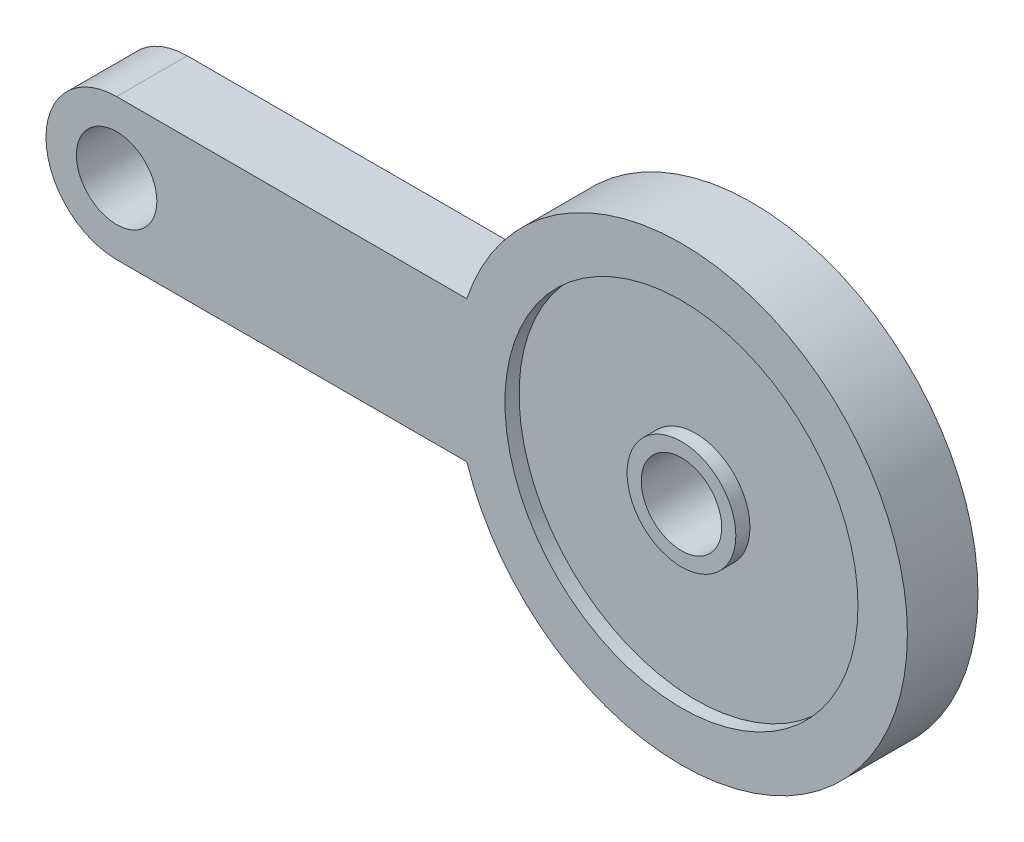
ISO-10303-21;
HEADER;
FILE_DESCRIPTION(('STEP AP214'),'2;1');
FILE_NAME('part.step','',(''),(''),'','','');
FILE_SCHEMA(('AUTOMOTIVE_DESIGN { 1 0 10303 214 1 1 1 1 }'));
ENDSEC;
DATA;
#1=APPLICATION_CONTEXT('core data for automotive mechanical design processes');
#2=APPLICATION_PROTOCOL_DEFINITION('international standard','automotive_design',2000,#1);
#3=PRODUCT_CONTEXT('',#1,'mechanical');
#4=PRODUCT('Part','Part','',(#3));
#5=PRODUCT_RELATED_PRODUCT_CATEGORY('part','',(#4));
#6=PRODUCT_DEFINITION_FORMATION('','',#4);
#7=PRODUCT_DEFINITION_CONTEXT('part definition',#1,'design');
#8=PRODUCT_DEFINITION('design','',#6,#7);
#9=PRODUCT_DEFINITION_SHAPE('','',#8);
#10=(LENGTH_UNIT() NAMED_UNIT(*) SI_UNIT(.MILLI.,.METRE.));
#11=(NAMED_UNIT(*) PLANE_ANGLE_UNIT() SI_UNIT($,.RADIAN.));
#12=(NAMED_UNIT(*) SI_UNIT($,.STERADIAN.) SOLID_ANGLE_UNIT());
#13=UNCERTAINTY_MEASURE_WITH_UNIT(LENGTH_MEASURE(1.E-05),#10,'distance_accuracy_value','');
#14=(GEOMETRIC_REPRESENTATION_CONTEXT(3) GLOBAL_UNCERTAINTY_ASSIGNED_CONTEXT((#13)) GLOBAL_UNIT_ASSIGNED_CONTEXT((#10,
#11,#12)) REPRESENTATION_CONTEXT('',''));
#15=CARTESIAN_POINT('',(0.,0.,0.));
#16=DIRECTION('',(0.,0.,1.));
#17=DIRECTION('',(1.,0.,0.));
#18=AXIS2_PLACEMENT_3D('',#15,#16,#17);
#19=CARTESIAN_POINT('',(20.,0.,1.5));
#20=DIRECTION('',(0.,0.,1.));
#21=DIRECTION('',(1.,0.,0.));
#22=AXIS2_PLACEMENT_3D('',#19,#20,#21);
#23=PLANE('',#22);
#24=CARTESIAN_POINT('',(20.,0.,1.5));
#25=DIRECTION('',(0.,0.,1.));
#26=DIRECTION('',(1.,0.,0.));
#27=AXIS2_PLACEMENT_3D('',#24,#25,#26);
#28=CIRCLE('',#27,12.5);
#29=CARTESIAN_POINT('',(32.5,0.,1.5));
#30=VERTEX_POINT('',#29);
#31=EDGE_CURVE('E80',#30,#30,#28,.T.);
#32=ORIENTED_EDGE('',*,*,#31,.T.);
#33=EDGE_LOOP('',(#32));
#34=FACE_BOUND('',#33,.T.);
#35=CARTESIAN_POINT('',(20.,0.,1.5));
#36=DIRECTION('',(0.,0.,1.));
#37=DIRECTION('',(1.,0.,0.));
#38=AXIS2_PLACEMENT_3D('',#35,#36,#37);
#39=CIRCLE('',#38,3.85);
#40=CARTESIAN_POINT('',(23.85,0.,1.5));
#41=VERTEX_POINT('',#40);
#42=EDGE_CURVE('E125',#41,#41,#39,.F.);
#43=ORIENTED_EDGE('',*,*,#42,.T.);
#44=EDGE_LOOP('',(#43));
#45=FACE_BOUND('',#44,.T.);
#46=ADVANCED_FACE('F34',(#34,#45),#23,.T.);
#47=CARTESIAN_POINT('',(20.,0.,-1.5));
#48=DIRECTION('',(0.,0.,1.));
#49=DIRECTION('',(1.,0.,0.));
#50=AXIS2_PLACEMENT_3D('',#47,#48,#49);
#51=PLANE('',#50);
#52=CARTESIAN_POINT('',(20.,0.,-1.5));
#53=DIRECTION('',(0.,0.,1.));
#54=DIRECTION('',(1.,0.,0.));
#55=AXIS2_PLACEMENT_3D('',#52,#53,#54);
#56=CIRCLE('',#55,12.5);
#57=CARTESIAN_POINT('',(32.5,0.,-1.5));
#58=VERTEX_POINT('',#57);
#59=EDGE_CURVE('E119',#58,#58,#56,.T.);
#60=ORIENTED_EDGE('',*,*,#59,.F.);
#61=EDGE_LOOP('',(#60));
#62=FACE_BOUND('',#61,.T.);
#63=CARTESIAN_POINT('',(20.,0.,-1.5));
#64=DIRECTION('',(0.,0.,1.));
#65=DIRECTION('',(1.,0.,0.));
#66=AXIS2_PLACEMENT_3D('',#63,#64,#65);
#67=CIRCLE('',#66,3.85);
#68=CARTESIAN_POINT('',(23.85,0.,-1.5));
#69=VERTEX_POINT('',#68);
#70=EDGE_CURVE('E11',#69,#69,#67,.F.);
#71=ORIENTED_EDGE('',*,*,#70,.F.);
#72=EDGE_LOOP('',(#71));
#73=FACE_BOUND('',#72,.T.);
#74=ADVANCED_FACE('F154',(#62,#73),#51,.F.);
#75=CARTESIAN_POINT('',(-20.,-5.,2.5));
#76=DIRECTION('',(0.,1.,0.));
#77=DIRECTION('',(-1.,0.,0.));
#78=AXIS2_PLACEMENT_3D('',#75,#76,#77);
#79=PLANE('',#78);
#80=DIRECTION('',(0.,0.,-1.));
#81=VECTOR('',#80,1.);
#82=CARTESIAN_POINT('',(4.80131584642933,-5.,2.5));
#83=LINE('',#82,#81);
#84=CARTESIAN_POINT('',(4.80131584642933,-5.,2.5));
#85=VERTEX_POINT('',#84);
#86=CARTESIAN_POINT('',(4.80131584642933,-5.,-2.5));
#87=VERTEX_POINT('',#86);
#88=EDGE_CURVE('E49',#85,#87,#83,.T.);
#89=ORIENTED_EDGE('',*,*,#88,.F.);
#90=DIRECTION('',(1.,0.,0.));
#91=VECTOR('',#90,1.);
#92=CARTESIAN_POINT('',(-20.,-5.,2.5));
#93=LINE('',#92,#91);
#94=CARTESIAN_POINT('',(-20.,-5.,2.5));
#95=VERTEX_POINT('',#94);
#96=EDGE_CURVE('E105',#95,#85,#93,.T.);
#97=ORIENTED_EDGE('',*,*,#96,.F.);
#98=DIRECTION('',(0.,0.,-1.));
#99=VECTOR('',#98,1.);
#100=CARTESIAN_POINT('',(-20.,-5.,2.5));
#101=LINE('',#100,#99);
#102=CARTESIAN_POINT('',(-20.,-5.,-2.5));
#103=VERTEX_POINT('',#102);
#104=EDGE_CURVE('E96',#95,#103,#101,.T.);
#105=ORIENTED_EDGE('',*,*,#104,.T.);
#106=DIRECTION('',(1.,0.,0.));
#107=VECTOR('',#106,1.);
#108=CARTESIAN_POINT('',(-20.,-5.,-2.5));
#109=LINE('',#108,#107);
#110=EDGE_CURVE('E54',#103,#87,#109,.T.);
#111=ORIENTED_EDGE('',*,*,#110,.T.);
#112=EDGE_LOOP('',(#89,#97,#105,#111));
#113=FACE_BOUND('',#112,.T.);
#114=ADVANCED_FACE('F156',(#113),#79,.F.);
#115=CARTESIAN_POINT('',(-20.,5.,2.5));
#116=DIRECTION('',(0.,-1.,0.));
#117=DIRECTION('',(1.,0.,0.));
#118=AXIS2_PLACEMENT_3D('',#115,#116,#117);
#119=PLANE('',#118);
#120=DIRECTION('',(0.,0.,-1.));
#121=VECTOR('',#120,1.);
#122=CARTESIAN_POINT('',(4.80131584642933,5.,2.5));
#123=LINE('',#122,#121);
#124=CARTESIAN_POINT('',(4.80131584642933,5.,-2.5));
#125=VERTEX_POINT('',#124);
#126=CARTESIAN_POINT('',(4.80131584642933,5.,2.5));
#127=VERTEX_POINT('',#126);
#128=EDGE_CURVE('E42',#125,#127,#123,.F.);
#129=ORIENTED_EDGE('',*,*,#128,.F.);
#130=DIRECTION('',(-1.,0.,0.));
#131=VECTOR('',#130,1.);
#132=CARTESIAN_POINT('',(-20.,5.,-2.5));
#133=LINE('',#132,#131);
#134=CARTESIAN_POINT('',(-20.,5.,-2.5));
#135=VERTEX_POINT('',#134);
#136=EDGE_CURVE('E83',#125,#135,#133,.T.);
#137=ORIENTED_EDGE('',*,*,#136,.T.);
#138=DIRECTION('',(0.,0.,-1.));
#139=VECTOR('',#138,1.);
#140=CARTESIAN_POINT('',(-20.,5.,2.5));
#141=LINE('',#140,#139);
#142=CARTESIAN_POINT('',(-20.,5.,2.5));
#143=VERTEX_POINT('',#142);
#144=EDGE_CURVE('E97',#143,#135,#141,.T.);
#145=ORIENTED_EDGE('',*,*,#144,.F.);
#146=DIRECTION('',(-1.,0.,0.));
#147=VECTOR('',#146,1.);
#148=CARTESIAN_POINT('',(-20.,5.,2.5));
#149=LINE('',#148,#147);
#150=EDGE_CURVE('E95',#127,#143,#149,.T.);
#151=ORIENTED_EDGE('',*,*,#150,.F.);
#152=EDGE_LOOP('',(#129,#137,#145,#151));
#153=FACE_BOUND('',#152,.T.);
#154=ADVANCED_FACE('F94',(#153),#119,.F.);
#155=CARTESIAN_POINT('',(-20.,0.,2.5));
#156=DIRECTION('',(0.,0.,1.));
#157=DIRECTION('',(1.,0.,0.));
#158=AXIS2_PLACEMENT_3D('',#155,#156,#157);
#159=PLANE('',#158);
#160=CARTESIAN_POINT('',(20.,0.,2.5));
#161=DIRECTION('',(0.,0.,1.));
#162=DIRECTION('',(1.,0.,0.));
#163=AXIS2_PLACEMENT_3D('',#160,#161,#162);
#164=CIRCLE('',#163,16.);
#165=EDGE_CURVE('E79',#85,#127,#164,.T.);
#166=ORIENTED_EDGE('',*,*,#165,.T.);
#167=ORIENTED_EDGE('',*,*,#150,.T.);
#168=CARTESIAN_POINT('',(-20.,0.,2.5));
#169=DIRECTION('',(0.,0.,1.));
#170=DIRECTION('',(1.,0.,0.));
#171=AXIS2_PLACEMENT_3D('',#168,#169,#170);
#172=CIRCLE('',#171,5.);
#173=EDGE_CURVE('E91',#143,#95,#172,.T.);
#174=ORIENTED_EDGE('',*,*,#173,.T.);
#175=ORIENTED_EDGE('',*,*,#96,.T.);
#176=EDGE_LOOP('',(#166,#167,#174,#175));
#177=FACE_BOUND('',#176,.T.);
#178=CARTESIAN_POINT('',(20.,0.,2.5));
#179=DIRECTION('',(0.,0.,1.));
#180=DIRECTION('',(1.,0.,0.));
#181=AXIS2_PLACEMENT_3D('',#178,#179,#180);
#182=CIRCLE('',#181,12.5);
#183=CARTESIAN_POINT('',(32.5,0.,2.5));
#184=VERTEX_POINT('',#183);
#185=EDGE_CURVE('E116',#184,#184,#182,.T.);
#186=ORIENTED_EDGE('',*,*,#185,.F.);
#187=EDGE_LOOP('',(#186));
#188=FACE_BOUND('',#187,.T.);
#189=CARTESIAN_POINT('',(-20.,0.,2.5));
#190=DIRECTION('',(0.,0.,1.));
#191=DIRECTION('',(1.,0.,0.));
#192=AXIS2_PLACEMENT_3D('',#189,#190,#191);
#193=CIRCLE('',#192,2.85);
#194=CARTESIAN_POINT('',(-17.15,0.,2.5));
#195=VERTEX_POINT('',#194);
#196=EDGE_CURVE('E103',#195,#195,#193,.T.);
#197=ORIENTED_EDGE('',*,*,#196,.F.);
#198=EDGE_LOOP('',(#197));
#199=FACE_BOUND('',#198,.T.);
#200=ADVANCED_FACE('F185',(#177,#188,#199),#159,.T.);
#201=CARTESIAN_POINT('',(-20.,0.,-2.5));
#202=DIRECTION('',(0.,0.,1.));
#203=DIRECTION('',(1.,0.,0.));
#204=AXIS2_PLACEMENT_3D('',#201,#202,#203);
#205=PLANE('',#204);
#206=CARTESIAN_POINT('',(20.,0.,-2.5));
#207=DIRECTION('',(0.,0.,1.));
#208=DIRECTION('',(1.,0.,0.));
#209=AXIS2_PLACEMENT_3D('',#206,#207,#208);
#210=CIRCLE('',#209,12.5);
#211=CARTESIAN_POINT('',(32.5,0.,-2.5));
#212=VERTEX_POINT('',#211);
#213=EDGE_CURVE('E122',#212,#212,#210,.T.);
#214=ORIENTED_EDGE('',*,*,#213,.T.);
#215=EDGE_LOOP('',(#214));
#216=FACE_BOUND('',#215,.T.);
#217=ORIENTED_EDGE('',*,*,#136,.F.);
#218=CARTESIAN_POINT('',(20.,0.,-2.5));
#219=DIRECTION('',(0.,0.,1.));
#220=DIRECTION('',(1.,0.,0.));
#221=AXIS2_PLACEMENT_3D('',#218,#219,#220);
#222=CIRCLE('',#221,16.);
#223=EDGE_CURVE('E73',#87,#125,#222,.T.);
#224=ORIENTED_EDGE('',*,*,#223,.F.);
#225=ORIENTED_EDGE('',*,*,#110,.F.);
#226=CARTESIAN_POINT('',(-20.,0.,-2.5));
#227=DIRECTION('',(0.,0.,1.));
#228=DIRECTION('',(1.,0.,0.));
#229=AXIS2_PLACEMENT_3D('',#226,#227,#228);
#230=CIRCLE('',#229,5.);
#231=EDGE_CURVE('E87',#135,#103,#230,.T.);
#232=ORIENTED_EDGE('',*,*,#231,.F.);
#233=EDGE_LOOP('',(#217,#224,#225,#232));
#234=FACE_BOUND('',#233,.T.);
#235=CARTESIAN_POINT('',(-20.,0.,-2.5));
#236=DIRECTION('',(0.,0.,1.));
#237=DIRECTION('',(1.,0.,0.));
#238=AXIS2_PLACEMENT_3D('',#235,#236,#237);
#239=CIRCLE('',#238,2.85);
#240=CARTESIAN_POINT('',(-17.15,0.,-2.5));
#241=VERTEX_POINT('',#240);
#242=EDGE_CURVE('E109',#241,#241,#239,.T.);
#243=ORIENTED_EDGE('',*,*,#242,.T.);
#244=EDGE_LOOP('',(#243));
#245=FACE_BOUND('',#244,.T.);
#246=ADVANCED_FACE('F84',(#216,#234,#245),#205,.F.);
#247=CARTESIAN_POINT('',(-20.,0.,2.5));
#248=DIRECTION('',(0.,0.,-1.));
#249=DIRECTION('',(-1.,0.,0.));
#250=AXIS2_PLACEMENT_3D('',#247,#248,#249);
#251=CYLINDRICAL_SURFACE('',#250,5.);
#252=ORIENTED_EDGE('',*,*,#231,.T.);
#253=ORIENTED_EDGE('',*,*,#104,.F.);
#254=ORIENTED_EDGE('',*,*,#173,.F.);
#255=ORIENTED_EDGE('',*,*,#144,.T.);
#256=EDGE_LOOP('',(#252,#253,#254,#255));
#257=FACE_BOUND('',#256,.T.);
#258=ADVANCED_FACE('F36',(#257),#251,.T.);
#259=CARTESIAN_POINT('',(-20.,0.,2.5));
#260=DIRECTION('',(0.,0.,-1.));
#261=DIRECTION('',(-1.,0.,0.));
#262=AXIS2_PLACEMENT_3D('',#259,#260,#261);
#263=CYLINDRICAL_SURFACE('',#262,2.85);
#264=ORIENTED_EDGE('',*,*,#196,.T.);
#265=EDGE_LOOP('',(#264));
#266=FACE_BOUND('',#265,.T.);
#267=ORIENTED_EDGE('',*,*,#242,.F.);
#268=EDGE_LOOP('',(#267));
#269=FACE_BOUND('',#268,.T.);
#270=ADVANCED_FACE('F177',(#266,#269),#263,.F.);
#271=CARTESIAN_POINT('',(20.,0.,2.5));
#272=DIRECTION('',(0.,0.,-1.));
#273=DIRECTION('',(-1.,0.,0.));
#274=AXIS2_PLACEMENT_3D('',#271,#272,#273);
#275=CYLINDRICAL_SURFACE('',#274,16.);
#276=ORIENTED_EDGE('',*,*,#223,.T.);
#277=ORIENTED_EDGE('',*,*,#128,.T.);
#278=ORIENTED_EDGE('',*,*,#165,.F.);
#279=ORIENTED_EDGE('',*,*,#88,.T.);
#280=EDGE_LOOP('',(#276,#277,#278,#279));
#281=FACE_BOUND('',#280,.T.);
#282=ADVANCED_FACE('F75',(#281),#275,.T.);
#283=CARTESIAN_POINT('',(20.,0.,1.5));
#284=DIRECTION('',(0.,0.,1.));
#285=DIRECTION('',(1.,0.,0.));
#286=AXIS2_PLACEMENT_3D('',#283,#284,#285);
#287=CYLINDRICAL_SURFACE('',#286,12.5);
#288=ORIENTED_EDGE('',*,*,#31,.F.);
#289=EDGE_LOOP('',(#288));
#290=FACE_BOUND('',#289,.T.);
#291=ORIENTED_EDGE('',*,*,#185,.T.);
#292=EDGE_LOOP('',(#291));
#293=FACE_BOUND('',#292,.T.);
#294=ADVANCED_FACE('F169',(#290,#293),#287,.F.);
#295=CARTESIAN_POINT('',(20.,0.,-1.5));
#296=DIRECTION('',(0.,0.,-1.));
#297=DIRECTION('',(-1.,0.,0.));
#298=AXIS2_PLACEMENT_3D('',#295,#296,#297);
#299=CYLINDRICAL_SURFACE('',#298,12.5);
#300=ORIENTED_EDGE('',*,*,#59,.T.);
#301=EDGE_LOOP('',(#300));
#302=FACE_BOUND('',#301,.T.);
#303=ORIENTED_EDGE('',*,*,#213,.F.);
#304=EDGE_LOOP('',(#303));
#305=FACE_BOUND('',#304,.T.);
#306=ADVANCED_FACE('F149',(#302,#305),#299,.F.);
#307=CARTESIAN_POINT('',(20.,0.,13.3894444302728));
#308=DIRECTION('',(0.,0.,-1.));
#309=DIRECTION('',(-1.,0.,0.));
#310=AXIS2_PLACEMENT_3D('',#307,#308,#309);
#311=CYLINDRICAL_SURFACE('',#310,3.85);
#312=CARTESIAN_POINT('',(20.,0.,-2.5));
#313=DIRECTION('',(0.,0.,1.));
#314=DIRECTION('',(1.,0.,0.));
#315=AXIS2_PLACEMENT_3D('',#312,#313,#314);
#316=CIRCLE('',#315,3.85);
#317=CARTESIAN_POINT('',(23.85,0.,-2.5));
#318=VERTEX_POINT('',#317);
#319=EDGE_CURVE('E139',#318,#318,#316,.F.);
#320=ORIENTED_EDGE('',*,*,#319,.F.);
#321=EDGE_LOOP('',(#320));
#322=FACE_BOUND('',#321,.T.);
#323=ORIENTED_EDGE('',*,*,#70,.T.);
#324=EDGE_LOOP('',(#323));
#325=FACE_BOUND('',#324,.T.);
#326=ADVANCED_FACE('F146',(#322,#325),#311,.T.);
#327=CARTESIAN_POINT('',(-20.,0.,-2.5));
#328=DIRECTION('',(0.,0.,1.));
#329=DIRECTION('',(1.,0.,0.));
#330=AXIS2_PLACEMENT_3D('',#327,#328,#329);
#331=PLANE('',#330);
#332=ORIENTED_EDGE('',*,*,#319,.T.);
#333=EDGE_LOOP('',(#332));
#334=FACE_BOUND('',#333,.T.);
#335=CARTESIAN_POINT('',(20.,0.,-2.5));
#336=DIRECTION('',(0.,0.,1.));
#337=DIRECTION('',(1.,0.,0.));
#338=AXIS2_PLACEMENT_3D('',#335,#336,#337);
#339=CIRCLE('',#338,2.85);
#340=CARTESIAN_POINT('',(22.85,0.,-2.5));
#341=VERTEX_POINT('',#340);
#342=EDGE_CURVE('E134',#341,#341,#339,.F.);
#343=ORIENTED_EDGE('',*,*,#342,.F.);
#344=EDGE_LOOP('',(#343));
#345=FACE_BOUND('',#344,.T.);
#346=ADVANCED_FACE('F143',(#334,#345),#331,.F.);
#347=CARTESIAN_POINT('',(20.,0.,2.5));
#348=DIRECTION('',(0.,0.,-1.));
#349=DIRECTION('',(-1.,0.,0.));
#350=AXIS2_PLACEMENT_3D('',#347,#348,#349);
#351=CYLINDRICAL_SURFACE('',#350,2.85);
#352=ORIENTED_EDGE('',*,*,#342,.T.);
#353=EDGE_LOOP('',(#352));
#354=FACE_BOUND('',#353,.T.);
#355=CARTESIAN_POINT('',(20.,0.,2.5));
#356=DIRECTION('',(0.,0.,1.));
#357=DIRECTION('',(1.,0.,0.));
#358=AXIS2_PLACEMENT_3D('',#355,#356,#357);
#359=CIRCLE('',#358,2.85);
#360=CARTESIAN_POINT('',(22.85,0.,2.5));
#361=VERTEX_POINT('',#360);
#362=EDGE_CURVE('E131',#361,#361,#359,.T.);
#363=ORIENTED_EDGE('',*,*,#362,.T.);
#364=EDGE_LOOP('',(#363));
#365=FACE_BOUND('',#364,.T.);
#366=ADVANCED_FACE('F178',(#354,#365),#351,.F.);
#367=ORIENTED_EDGE('',*,*,#42,.F.);
#368=EDGE_LOOP('',(#367));
#369=FACE_BOUND('',#368,.T.);
#370=CARTESIAN_POINT('',(20.,0.,2.5));
#371=DIRECTION('',(0.,0.,1.));
#372=DIRECTION('',(1.,0.,0.));
#373=AXIS2_PLACEMENT_3D('',#370,#371,#372);
#374=CIRCLE('',#373,3.85);
#375=CARTESIAN_POINT('',(23.85,0.,2.5));
#376=VERTEX_POINT('',#375);
#377=EDGE_CURVE('E130',#376,#376,#374,.T.);
#378=ORIENTED_EDGE('',*,*,#377,.F.);
#379=EDGE_LOOP('',(#378));
#380=FACE_BOUND('',#379,.T.);
#381=ADVANCED_FACE('F151',(#369,#380),#311,.T.);
#382=CARTESIAN_POINT('',(-20.,0.,2.5));
#383=DIRECTION('',(0.,0.,1.));
#384=DIRECTION('',(1.,0.,0.));
#385=AXIS2_PLACEMENT_3D('',#382,#383,#384);
#386=PLANE('',#385);
#387=ORIENTED_EDGE('',*,*,#362,.F.);
#388=EDGE_LOOP('',(#387));
#389=FACE_BOUND('',#388,.T.);
#390=ORIENTED_EDGE('',*,*,#377,.T.);
#391=EDGE_LOOP('',(#390));
#392=FACE_BOUND('',#391,.T.);
#393=ADVANCED_FACE('F249',(#389,#392),#386,.T.);
#394=CLOSED_SHELL('',(#46,#74,#114,#154,#200,#246,#258,#270,#282,#294,#306,#326,#346,#366,#381,#393));
#395=MANIFOLD_SOLID_BREP('B2',#394);
#396=ADVANCED_BREP_SHAPE_REPRESENTATION('',(#18,#395),#14);
#397=SHAPE_DEFINITION_REPRESENTATION(#9,#396);
ENDSEC;
END-ISO-10303-21;
